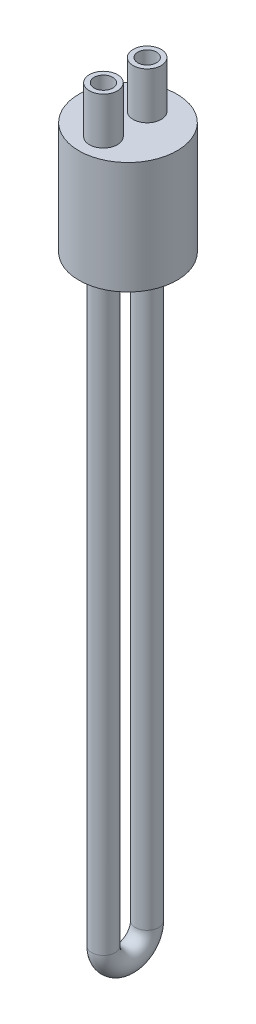
ISO-10303-21;
HEADER;
FILE_DESCRIPTION(('STEP AP214'),'2;1');
FILE_NAME('part.step','',(''),(''),'','','');
FILE_SCHEMA(('AUTOMOTIVE_DESIGN { 1 0 10303 214 1 1 1 1 }'));
ENDSEC;
DATA;
#1=APPLICATION_CONTEXT('core data for automotive mechanical design processes');
#2=APPLICATION_PROTOCOL_DEFINITION('international standard','automotive_design',2000,#1);
#3=PRODUCT_CONTEXT('',#1,'mechanical');
#4=PRODUCT('Part','Part','',(#3));
#5=PRODUCT_RELATED_PRODUCT_CATEGORY('part','',(#4));
#6=PRODUCT_DEFINITION_FORMATION('','',#4);
#7=PRODUCT_DEFINITION_CONTEXT('part definition',#1,'design');
#8=PRODUCT_DEFINITION('design','',#6,#7);
#9=PRODUCT_DEFINITION_SHAPE('','',#8);
#10=(LENGTH_UNIT() NAMED_UNIT(*) SI_UNIT(.MILLI.,.METRE.));
#11=(NAMED_UNIT(*) PLANE_ANGLE_UNIT() SI_UNIT($,.RADIAN.));
#12=(NAMED_UNIT(*) SI_UNIT($,.STERADIAN.) SOLID_ANGLE_UNIT());
#13=UNCERTAINTY_MEASURE_WITH_UNIT(LENGTH_MEASURE(1.E-05),#10,'distance_accuracy_value','');
#14=(GEOMETRIC_REPRESENTATION_CONTEXT(3) GLOBAL_UNCERTAINTY_ASSIGNED_CONTEXT((#13)) GLOBAL_UNIT_ASSIGNED_CONTEXT((#10,
#11,#12)) REPRESENTATION_CONTEXT('',''));
#15=CARTESIAN_POINT('',(0.,0.,0.));
#16=DIRECTION('',(0.,0.,1.));
#17=DIRECTION('',(1.,0.,0.));
#18=AXIS2_PLACEMENT_3D('',#15,#16,#17);
#19=CARTESIAN_POINT('',(0.,48.,-8.21783942349473));
#20=DIRECTION('',(0.,-1.,0.));
#21=DIRECTION('',(0.,0.,-1.));
#22=AXIS2_PLACEMENT_3D('',#19,#20,#21);
#23=CYLINDRICAL_SURFACE('',#22,4.);
#24=CARTESIAN_POINT('',(0.,68.,-8.21783942349473));
#25=DIRECTION('',(0.,1.,0.));
#26=DIRECTION('',(0.,0.,1.));
#27=AXIS2_PLACEMENT_3D('',#24,#25,#26);
#28=CIRCLE('',#27,4.);
#29=CARTESIAN_POINT('',(0.,68.,-4.21783942349473));
#30=VERTEX_POINT('',#29);
#31=EDGE_CURVE('E97',#30,#30,#28,.F.);
#32=ORIENTED_EDGE('',*,*,#31,.F.);
#33=EDGE_LOOP('',(#32));
#34=FACE_BOUND('',#33,.T.);
#35=CARTESIAN_POINT('',(0.,42.,-8.21783942349473));
#36=DIRECTION('',(0.,-1.,0.));
#37=DIRECTION('',(0.,0.,-1.));
#38=AXIS2_PLACEMENT_3D('',#35,#36,#37);
#39=CIRCLE('',#38,4.);
#40=CARTESIAN_POINT('',(3.99989857790224,42.,-8.18935492778884));
#41=VERTEX_POINT('',#40);
#42=CARTESIAN_POINT('',(-3.99989857790224,42.,-8.18935492778884));
#43=VERTEX_POINT('',#42);
#44=EDGE_CURVE('E79',#41,#43,#39,.T.);
#45=ORIENTED_EDGE('',*,*,#44,.T.);
#46=DIRECTION('',(0.,1.,0.));
#47=VECTOR('',#46,1.);
#48=CARTESIAN_POINT('',(-3.99989857790224,45.,-8.18935492778884));
#49=LINE('',#48,#47);
#50=CARTESIAN_POINT('',(-3.99989857790224,48.,-8.18935492778884));
#51=VERTEX_POINT('',#50);
#52=EDGE_CURVE('E54',#43,#51,#49,.T.);
#53=ORIENTED_EDGE('',*,*,#52,.T.);
#54=CARTESIAN_POINT('',(0.,48.,-8.21783942349473));
#55=DIRECTION('',(0.,1.,0.));
#56=DIRECTION('',(0.,0.,1.));
#57=AXIS2_PLACEMENT_3D('',#54,#55,#56);
#58=CIRCLE('',#57,4.);
#59=CARTESIAN_POINT('',(3.99989857790224,48.,-8.18935492778884));
#60=VERTEX_POINT('',#59);
#61=EDGE_CURVE('E11',#60,#51,#58,.T.);
#62=ORIENTED_EDGE('',*,*,#61,.F.);
#63=DIRECTION('',(0.,1.,0.));
#64=VECTOR('',#63,1.);
#65=CARTESIAN_POINT('',(3.99989857790224,45.,-8.18935492778884));
#66=LINE('',#65,#64);
#67=EDGE_CURVE('E63',#60,#41,#66,.F.);
#68=ORIENTED_EDGE('',*,*,#67,.T.);
#69=EDGE_LOOP('',(#45,#53,#62,#68));
#70=FACE_BOUND('',#69,.T.);
#71=ADVANCED_FACE('F38',(#34,#70),#23,.F.);
#72=CARTESIAN_POINT('',(0.,42.,0.));
#73=DIRECTION('',(0.,-1.,0.));
#74=DIRECTION('',(0.,0.,-1.));
#75=AXIS2_PLACEMENT_3D('',#72,#73,#74);
#76=PLANE('',#75);
#77=ORIENTED_EDGE('',*,*,#44,.F.);
#78=CARTESIAN_POINT('',(0.,42.,-8.16087043208294));
#79=DIRECTION('',(0.,-1.,0.));
#80=DIRECTION('',(0.,0.,-1.));
#81=AXIS2_PLACEMENT_3D('',#78,#79,#80);
#82=CIRCLE('',#81,4.);
#83=EDGE_CURVE('E58',#41,#43,#82,.T.);
#84=ORIENTED_EDGE('',*,*,#83,.T.);
#85=EDGE_LOOP('',(#77,#84));
#86=FACE_BOUND('',#85,.T.);
#87=ADVANCED_FACE('F167',(#86),#76,.T.);
#88=CARTESIAN_POINT('',(0.,48.,0.));
#89=DIRECTION('',(0.,1.,0.));
#90=DIRECTION('',(0.,0.,1.));
#91=AXIS2_PLACEMENT_3D('',#88,#89,#90);
#92=PLANE('',#91);
#93=CARTESIAN_POINT('',(0.,48.,-8.21783942349473));
#94=DIRECTION('',(0.,1.,0.));
#95=DIRECTION('',(0.,0.,1.));
#96=AXIS2_PLACEMENT_3D('',#93,#94,#95);
#97=CIRCLE('',#96,6.);
#98=CARTESIAN_POINT('',(0.,48.,-2.21783942349473));
#99=VERTEX_POINT('',#98);
#100=EDGE_CURVE('E95',#99,#99,#97,.T.);
#101=ORIENTED_EDGE('',*,*,#100,.F.);
#102=EDGE_LOOP('',(#101));
#103=FACE_BOUND('',#102,.T.);
#104=CARTESIAN_POINT('',(0.,48.,0.));
#105=DIRECTION('',(0.,1.,0.));
#106=DIRECTION('',(0.,0.,1.));
#107=AXIS2_PLACEMENT_3D('',#104,#105,#106);
#108=CIRCLE('',#107,21.);
#109=CARTESIAN_POINT('',(0.,48.,21.));
#110=VERTEX_POINT('',#109);
#111=EDGE_CURVE('E116',#110,#110,#108,.T.);
#112=ORIENTED_EDGE('',*,*,#111,.T.);
#113=EDGE_LOOP('',(#112));
#114=FACE_BOUND('',#113,.T.);
#115=CARTESIAN_POINT('',(0.,48.,10.4957757721968));
#116=DIRECTION('',(0.,1.,0.));
#117=DIRECTION('',(0.,0.,1.));
#118=AXIS2_PLACEMENT_3D('',#115,#116,#117);
#119=CIRCLE('',#118,6.);
#120=CARTESIAN_POINT('',(0.,48.,16.4957757721968));
#121=VERTEX_POINT('',#120);
#122=EDGE_CURVE('E81',#121,#121,#119,.T.);
#123=ORIENTED_EDGE('',*,*,#122,.F.);
#124=EDGE_LOOP('',(#123));
#125=FACE_BOUND('',#124,.T.);
#126=ADVANCED_FACE('F173',(#103,#114,#125),#92,.T.);
#127=CARTESIAN_POINT('',(0.,48.,10.4957757721968));
#128=DIRECTION('',(0.,-1.,0.));
#129=DIRECTION('',(0.,0.,-1.));
#130=AXIS2_PLACEMENT_3D('',#127,#128,#129);
#131=CYLINDRICAL_SURFACE('',#130,4.);
#132=CARTESIAN_POINT('',(0.,68.,10.4957757721968));
#133=DIRECTION('',(0.,1.,0.));
#134=DIRECTION('',(0.,0.,1.));
#135=AXIS2_PLACEMENT_3D('',#132,#133,#134);
#136=CIRCLE('',#135,4.);
#137=CARTESIAN_POINT('',(0.,68.,14.4957757721968));
#138=VERTEX_POINT('',#137);
#139=EDGE_CURVE('E86',#138,#138,#136,.F.);
#140=ORIENTED_EDGE('',*,*,#139,.F.);
#141=EDGE_LOOP('',(#140));
#142=FACE_BOUND('',#141,.T.);
#143=CARTESIAN_POINT('',(0.,-252.,10.4957757721968));
#144=DIRECTION('',(0.,-1.,0.));
#145=DIRECTION('',(0.,0.,-1.));
#146=AXIS2_PLACEMENT_3D('',#143,#144,#145);
#147=CIRCLE('',#146,4.);
#148=CARTESIAN_POINT('',(0.,-252.,14.4957757721968));
#149=VERTEX_POINT('',#148);
#150=EDGE_CURVE('E239',#149,#149,#147,.T.);
#151=ORIENTED_EDGE('',*,*,#150,.T.);
#152=EDGE_LOOP('',(#151));
#153=FACE_BOUND('',#152,.T.);
#154=ADVANCED_FACE('F181',(#142,#153),#131,.F.);
#155=CARTESIAN_POINT('',(0.,0.,0.));
#156=DIRECTION('',(0.,1.,0.));
#157=DIRECTION('',(0.,0.,1.));
#158=AXIS2_PLACEMENT_3D('',#155,#156,#157);
#159=PLANE('',#158);
#160=CARTESIAN_POINT('',(0.,0.,0.));
#161=DIRECTION('',(0.,-1.,0.));
#162=DIRECTION('',(0.,0.,-1.));
#163=AXIS2_PLACEMENT_3D('',#160,#161,#162);
#164=CIRCLE('',#163,19.);
#165=CARTESIAN_POINT('',(0.,0.,-19.));
#166=VERTEX_POINT('',#165);
#167=EDGE_CURVE('E105',#166,#166,#164,.T.);
#168=ORIENTED_EDGE('',*,*,#167,.F.);
#169=EDGE_LOOP('',(#168));
#170=FACE_BOUND('',#169,.T.);
#171=CARTESIAN_POINT('',(0.,0.,0.));
#172=DIRECTION('',(0.,1.,0.));
#173=DIRECTION('',(0.,0.,1.));
#174=AXIS2_PLACEMENT_3D('',#171,#172,#173);
#175=CIRCLE('',#174,21.);
#176=CARTESIAN_POINT('',(0.,0.,21.));
#177=VERTEX_POINT('',#176);
#178=EDGE_CURVE('E120',#177,#177,#175,.T.);
#179=ORIENTED_EDGE('',*,*,#178,.F.);
#180=EDGE_LOOP('',(#179));
#181=FACE_BOUND('',#180,.T.);
#182=ADVANCED_FACE('F184',(#170,#181),#159,.F.);
#183=CARTESIAN_POINT('',(0.,48.,0.));
#184=DIRECTION('',(0.,-1.,0.));
#185=DIRECTION('',(0.,0.,-1.));
#186=AXIS2_PLACEMENT_3D('',#183,#184,#185);
#187=CYLINDRICAL_SURFACE('',#186,21.);
#188=ORIENTED_EDGE('',*,*,#111,.F.);
#189=EDGE_LOOP('',(#188));
#190=FACE_BOUND('',#189,.T.);
#191=ORIENTED_EDGE('',*,*,#178,.T.);
#192=EDGE_LOOP('',(#191));
#193=FACE_BOUND('',#192,.T.);
#194=ADVANCED_FACE('F40',(#190,#193),#187,.T.);
#195=CARTESIAN_POINT('',(0.,42.,0.));
#196=DIRECTION('',(0.,-1.,0.));
#197=DIRECTION('',(0.,0.,-1.));
#198=AXIS2_PLACEMENT_3D('',#195,#196,#197);
#199=CYLINDRICAL_SURFACE('',#198,19.);
#200=CARTESIAN_POINT('',(0.,42.,0.));
#201=DIRECTION('',(0.,-1.,0.));
#202=DIRECTION('',(0.,0.,-1.));
#203=AXIS2_PLACEMENT_3D('',#200,#201,#202);
#204=CIRCLE('',#203,19.);
#205=CARTESIAN_POINT('',(0.,42.,-19.));
#206=VERTEX_POINT('',#205);
#207=EDGE_CURVE('E109',#206,#206,#204,.T.);
#208=ORIENTED_EDGE('',*,*,#207,.F.);
#209=EDGE_LOOP('',(#208));
#210=FACE_BOUND('',#209,.T.);
#211=ORIENTED_EDGE('',*,*,#167,.T.);
#212=EDGE_LOOP('',(#211));
#213=FACE_BOUND('',#212,.T.);
#214=ADVANCED_FACE('F180',(#210,#213),#199,.F.);
#215=CARTESIAN_POINT('',(0.,42.,10.4957757721968));
#216=DIRECTION('',(0.,-1.,0.));
#217=DIRECTION('',(0.,0.,-1.));
#218=AXIS2_PLACEMENT_3D('',#215,#216,#217);
#219=CIRCLE('',#218,5.);
#220=CARTESIAN_POINT('',(0.,42.,5.49577577219681));
#221=VERTEX_POINT('',#220);
#222=EDGE_CURVE('E47',#221,#221,#219,.T.);
#223=ORIENTED_EDGE('',*,*,#222,.F.);
#224=EDGE_LOOP('',(#223));
#225=FACE_BOUND('',#224,.T.);
#226=CARTESIAN_POINT('',(0.,42.,-8.16087043208294));
#227=DIRECTION('',(0.,-1.,0.));
#228=DIRECTION('',(0.,0.,-1.));
#229=AXIS2_PLACEMENT_3D('',#226,#227,#228);
#230=CIRCLE('',#229,5.);
#231=CARTESIAN_POINT('',(0.,42.,-13.1608704320829));
#232=VERTEX_POINT('',#231);
#233=EDGE_CURVE('E126',#232,#232,#230,.T.);
#234=ORIENTED_EDGE('',*,*,#233,.F.);
#235=EDGE_LOOP('',(#234));
#236=FACE_BOUND('',#235,.T.);
#237=ORIENTED_EDGE('',*,*,#207,.T.);
#238=EDGE_LOOP('',(#237));
#239=FACE_BOUND('',#238,.T.);
#240=ADVANCED_FACE('F176',(#225,#236,#239),#76,.T.);
#241=CARTESIAN_POINT('',(0.,68.,-8.21783942349473));
#242=DIRECTION('',(0.,-1.,0.));
#243=DIRECTION('',(0.,0.,-1.));
#244=AXIS2_PLACEMENT_3D('',#241,#242,#243);
#245=CYLINDRICAL_SURFACE('',#244,6.);
#246=CARTESIAN_POINT('',(0.,68.,-8.21783942349473));
#247=DIRECTION('',(0.,1.,0.));
#248=DIRECTION('',(0.,0.,1.));
#249=AXIS2_PLACEMENT_3D('',#246,#247,#248);
#250=CIRCLE('',#249,6.);
#251=CARTESIAN_POINT('',(0.,68.,-2.21783942349473));
#252=VERTEX_POINT('',#251);
#253=EDGE_CURVE('E101',#252,#252,#250,.T.);
#254=ORIENTED_EDGE('',*,*,#253,.F.);
#255=EDGE_LOOP('',(#254));
#256=FACE_BOUND('',#255,.T.);
#257=ORIENTED_EDGE('',*,*,#100,.T.);
#258=EDGE_LOOP('',(#257));
#259=FACE_BOUND('',#258,.T.);
#260=ADVANCED_FACE('F204',(#256,#259),#245,.T.);
#261=CARTESIAN_POINT('',(-46.3414213562373,68.,0.));
#262=DIRECTION('',(0.,1.,0.));
#263=DIRECTION('',(0.,0.,1.));
#264=AXIS2_PLACEMENT_3D('',#261,#262,#263);
#265=PLANE('',#264);
#266=ORIENTED_EDGE('',*,*,#31,.T.);
#267=EDGE_LOOP('',(#266));
#268=FACE_BOUND('',#267,.T.);
#269=ORIENTED_EDGE('',*,*,#253,.T.);
#270=EDGE_LOOP('',(#269));
#271=FACE_BOUND('',#270,.T.);
#272=ADVANCED_FACE('F211',(#268,#271),#265,.T.);
#273=CARTESIAN_POINT('',(0.,68.,10.4957757721968));
#274=DIRECTION('',(0.,-1.,0.));
#275=DIRECTION('',(0.,0.,-1.));
#276=AXIS2_PLACEMENT_3D('',#273,#274,#275);
#277=CYLINDRICAL_SURFACE('',#276,6.);
#278=CARTESIAN_POINT('',(0.,68.,10.4957757721968));
#279=DIRECTION('',(0.,1.,0.));
#280=DIRECTION('',(0.,0.,1.));
#281=AXIS2_PLACEMENT_3D('',#278,#279,#280);
#282=CIRCLE('',#281,6.);
#283=CARTESIAN_POINT('',(0.,68.,16.4957757721968));
#284=VERTEX_POINT('',#283);
#285=EDGE_CURVE('E92',#284,#284,#282,.T.);
#286=ORIENTED_EDGE('',*,*,#285,.F.);
#287=EDGE_LOOP('',(#286));
#288=FACE_BOUND('',#287,.T.);
#289=ORIENTED_EDGE('',*,*,#122,.T.);
#290=EDGE_LOOP('',(#289));
#291=FACE_BOUND('',#290,.T.);
#292=ADVANCED_FACE('F218',(#288,#291),#277,.T.);
#293=CARTESIAN_POINT('',(-46.3414213562373,68.,0.));
#294=DIRECTION('',(0.,1.,0.));
#295=DIRECTION('',(0.,0.,1.));
#296=AXIS2_PLACEMENT_3D('',#293,#294,#295);
#297=PLANE('',#296);
#298=ORIENTED_EDGE('',*,*,#139,.T.);
#299=EDGE_LOOP('',(#298));
#300=FACE_BOUND('',#299,.T.);
#301=ORIENTED_EDGE('',*,*,#285,.T.);
#302=EDGE_LOOP('',(#301));
#303=FACE_BOUND('',#302,.T.);
#304=ADVANCED_FACE('F222',(#300,#303),#297,.T.);
#305=CARTESIAN_POINT('',(0.,-252.,1.16745267005691));
#306=DIRECTION('',(1.,0.,0.));
#307=DIRECTION('',(0.,0.,-1.));
#308=AXIS2_PLACEMENT_3D('',#305,#306,#307);
#309=TOROIDAL_SURFACE('',#308,9.32832310213989,4.);
#310=CARTESIAN_POINT('',(0.,-252.,-8.16087043208298));
#311=DIRECTION('',(0.,1.,0.));
#312=DIRECTION('',(0.,0.,1.));
#313=AXIS2_PLACEMENT_3D('',#310,#311,#312);
#314=CIRCLE('',#313,4.);
#315=CARTESIAN_POINT('',(0.,-252.,-12.160870432083));
#316=VERTEX_POINT('',#315);
#317=EDGE_CURVE('E141',#316,#316,#314,.T.);
#318=CARTESIAN_POINT('',(0.,-252.,1.16745267005691));
#319=DIRECTION('',(1.,0.,0.));
#320=DIRECTION('',(0.,0.,-1.));
#321=AXIS2_PLACEMENT_3D('',#318,#319,#320);
#322=CIRCLE('',#321,13.3283231021399);
#323=EDGE_CURVE('',#149,#316,#322,.T.);
#324=ORIENTED_EDGE('',*,*,#150,.F.);
#325=ORIENTED_EDGE('',*,*,#317,.T.);
#326=ORIENTED_EDGE('',*,*,#323,.T.);
#327=ORIENTED_EDGE('',*,*,#323,.F.);
#328=EDGE_LOOP('',(#324,#326,#325,#327));
#329=FACE_BOUND('',#328,.T.);
#330=ADVANCED_FACE('F225',(#329),#309,.F.);
#331=CARTESIAN_POINT('',(0.,-252.,-8.16087043208298));
#332=DIRECTION('',(0.,1.,0.));
#333=DIRECTION('',(0.,0.,1.));
#334=AXIS2_PLACEMENT_3D('',#331,#332,#333);
#335=CYLINDRICAL_SURFACE('',#334,4.);
#336=ORIENTED_EDGE('',*,*,#52,.F.);
#337=ORIENTED_EDGE('',*,*,#83,.F.);
#338=ORIENTED_EDGE('',*,*,#67,.F.);
#339=CARTESIAN_POINT('',(0.,48.,-8.16087043208294));
#340=DIRECTION('',(0.,1.,0.));
#341=DIRECTION('',(0.,0.,1.));
#342=AXIS2_PLACEMENT_3D('',#339,#340,#341);
#343=CIRCLE('',#342,4.);
#344=EDGE_CURVE('E67',#60,#51,#343,.T.);
#345=ORIENTED_EDGE('',*,*,#344,.T.);
#346=EDGE_LOOP('',(#336,#337,#338,#345));
#347=FACE_BOUND('',#346,.T.);
#348=ORIENTED_EDGE('',*,*,#317,.F.);
#349=EDGE_LOOP('',(#348));
#350=FACE_BOUND('',#349,.T.);
#351=ADVANCED_FACE('F65',(#347,#350),#335,.F.);
#352=CARTESIAN_POINT('',(0.,48.,-8.16087043208294));
#353=DIRECTION('',(0.,1.,0.));
#354=DIRECTION('',(0.,0.,1.));
#355=AXIS2_PLACEMENT_3D('',#352,#353,#354);
#356=PLANE('',#355);
#357=ORIENTED_EDGE('',*,*,#344,.F.);
#358=ORIENTED_EDGE('',*,*,#61,.T.);
#359=EDGE_LOOP('',(#357,#358));
#360=FACE_BOUND('',#359,.T.);
#361=ADVANCED_FACE('F75',(#360),#356,.T.);
#362=CARTESIAN_POINT('',(0.,-252.,-8.16087043208298));
#363=DIRECTION('',(0.,1.,0.));
#364=DIRECTION('',(0.,0.,1.));
#365=AXIS2_PLACEMENT_3D('',#362,#363,#364);
#366=CYLINDRICAL_SURFACE('',#365,5.);
#367=ORIENTED_EDGE('',*,*,#233,.T.);
#368=EDGE_LOOP('',(#367));
#369=FACE_BOUND('',#368,.T.);
#370=CARTESIAN_POINT('',(0.,-252.,-8.16087043208298));
#371=DIRECTION('',(0.,1.,0.));
#372=DIRECTION('',(0.,0.,1.));
#373=AXIS2_PLACEMENT_3D('',#370,#371,#372);
#374=CIRCLE('',#373,5.);
#375=CARTESIAN_POINT('',(0.,-252.,-13.160870432083));
#376=VERTEX_POINT('',#375);
#377=EDGE_CURVE('E77',#376,#376,#374,.T.);
#378=ORIENTED_EDGE('',*,*,#377,.T.);
#379=EDGE_LOOP('',(#378));
#380=FACE_BOUND('',#379,.T.);
#381=ADVANCED_FACE('F149',(#369,#380),#366,.T.);
#382=CARTESIAN_POINT('',(0.,-252.,1.16745267005691));
#383=DIRECTION('',(1.,0.,0.));
#384=DIRECTION('',(0.,0.,-1.));
#385=AXIS2_PLACEMENT_3D('',#382,#383,#384);
#386=TOROIDAL_SURFACE('',#385,9.32832310213989,5.);
#387=CARTESIAN_POINT('',(0.,-252.,10.4957757721968));
#388=DIRECTION('',(0.,-1.,0.));
#389=DIRECTION('',(0.,0.,-1.));
#390=AXIS2_PLACEMENT_3D('',#387,#388,#389);
#391=CIRCLE('',#390,5.);
#392=CARTESIAN_POINT('',(0.,-252.,15.4957757721968));
#393=VERTEX_POINT('',#392);
#394=EDGE_CURVE('E139',#393,#393,#391,.T.);
#395=CARTESIAN_POINT('',(0.,-252.,1.16745267005691));
#396=DIRECTION('',(1.,0.,0.));
#397=DIRECTION('',(0.,0.,-1.));
#398=AXIS2_PLACEMENT_3D('',#395,#396,#397);
#399=CIRCLE('',#398,14.3283231021399);
#400=EDGE_CURVE('',#393,#376,#399,.T.);
#401=ORIENTED_EDGE('',*,*,#394,.T.);
#402=ORIENTED_EDGE('',*,*,#377,.F.);
#403=ORIENTED_EDGE('',*,*,#400,.T.);
#404=ORIENTED_EDGE('',*,*,#400,.F.);
#405=EDGE_LOOP('',(#401,#403,#402,#404));
#406=FACE_BOUND('',#405,.T.);
#407=ADVANCED_FACE('F151',(#406),#386,.T.);
#408=CARTESIAN_POINT('',(0.,-252.,10.4957757721968));
#409=DIRECTION('',(0.,1.,0.));
#410=DIRECTION('',(0.,0.,1.));
#411=AXIS2_PLACEMENT_3D('',#408,#409,#410);
#412=CYLINDRICAL_SURFACE('',#411,5.);
#413=ORIENTED_EDGE('',*,*,#394,.F.);
#414=EDGE_LOOP('',(#413));
#415=FACE_BOUND('',#414,.T.);
#416=ORIENTED_EDGE('',*,*,#222,.T.);
#417=EDGE_LOOP('',(#416));
#418=FACE_BOUND('',#417,.T.);
#419=ADVANCED_FACE('F153',(#415,#418),#412,.T.);
#420=CLOSED_SHELL('',(#71,#87,#126,#154,#182,#194,#214,#240,#260,#272,#292,#304,#330,#351,#361,
#381,#407,#419));
#421=MANIFOLD_SOLID_BREP('B2',#420);
#422=ADVANCED_BREP_SHAPE_REPRESENTATION('',(#18,#421),#14);
#423=SHAPE_DEFINITION_REPRESENTATION(#9,#422);
ENDSEC;
END-ISO-10303-21;
